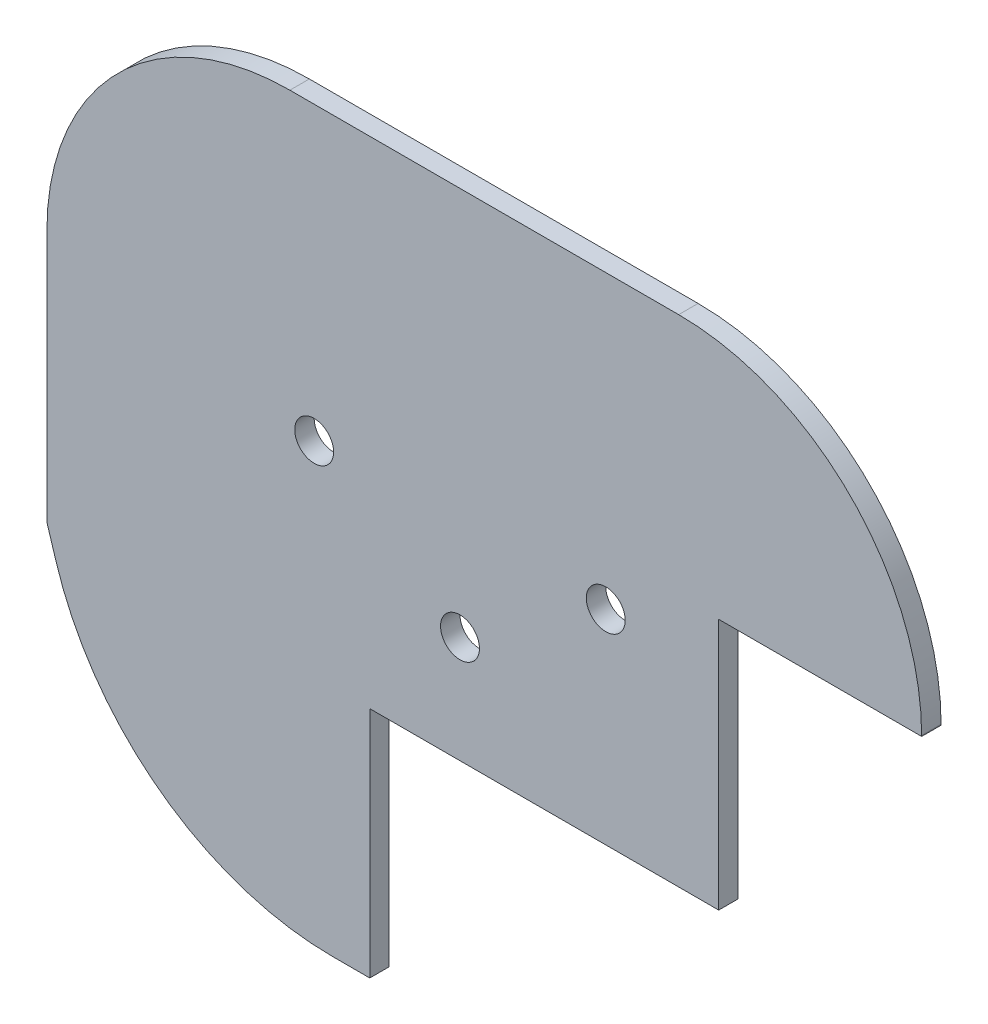
ISO-10303-21;
HEADER;
FILE_DESCRIPTION(('STEP AP214'),'2;1');
FILE_NAME('part.step','',(''),(''),'','','');
FILE_SCHEMA(('AUTOMOTIVE_DESIGN { 1 0 10303 214 1 1 1 1 }'));
ENDSEC;
DATA;
#1=APPLICATION_CONTEXT('core data for automotive mechanical design processes');
#2=APPLICATION_PROTOCOL_DEFINITION('international standard','automotive_design',2000,#1);
#3=PRODUCT_CONTEXT('',#1,'mechanical');
#4=PRODUCT('Part','Part','',(#3));
#5=PRODUCT_RELATED_PRODUCT_CATEGORY('part','',(#4));
#6=PRODUCT_DEFINITION_FORMATION('','',#4);
#7=PRODUCT_DEFINITION_CONTEXT('part definition',#1,'design');
#8=PRODUCT_DEFINITION('design','',#6,#7);
#9=PRODUCT_DEFINITION_SHAPE('','',#8);
#10=(LENGTH_UNIT() NAMED_UNIT(*) SI_UNIT(.MILLI.,.METRE.));
#11=(NAMED_UNIT(*) PLANE_ANGLE_UNIT() SI_UNIT($,.RADIAN.));
#12=(NAMED_UNIT(*) SI_UNIT($,.STERADIAN.) SOLID_ANGLE_UNIT());
#13=UNCERTAINTY_MEASURE_WITH_UNIT(LENGTH_MEASURE(1.E-05),#10,'distance_accuracy_value','');
#14=(GEOMETRIC_REPRESENTATION_CONTEXT(3) GLOBAL_UNCERTAINTY_ASSIGNED_CONTEXT((#13)) GLOBAL_UNIT_ASSIGNED_CONTEXT((#10,
#11,#12)) REPRESENTATION_CONTEXT('',''));
#15=CARTESIAN_POINT('',(0.,0.,0.));
#16=DIRECTION('',(0.,0.,1.));
#17=DIRECTION('',(1.,0.,0.));
#18=AXIS2_PLACEMENT_3D('',#15,#16,#17);
#19=CARTESIAN_POINT('',(0.,0.,0.));
#20=DIRECTION('',(0.,0.,1.));
#21=DIRECTION('',(1.,0.,0.));
#22=AXIS2_PLACEMENT_3D('',#19,#20,#21);
#23=PLANE('',#22);
#24=CARTESIAN_POINT('',(-8.65887450304571,10.5,0.));
#25=DIRECTION('',(0.,0.,1.));
#26=DIRECTION('',(1.,0.,0.));
#27=AXIS2_PLACEMENT_3D('',#24,#25,#26);
#28=CIRCLE('',#27,1.);
#29=CARTESIAN_POINT('',(-7.65887450304571,10.5,0.));
#30=VERTEX_POINT('',#29);
#31=EDGE_CURVE('E161',#30,#30,#28,.T.);
#32=ORIENTED_EDGE('',*,*,#31,.T.);
#33=EDGE_LOOP('',(#32));
#34=FACE_BOUND('',#33,.T.);
#35=CARTESIAN_POINT('',(-23.6588745030457,10.5,0.));
#36=DIRECTION('',(0.,0.,1.));
#37=DIRECTION('',(1.,0.,0.));
#38=AXIS2_PLACEMENT_3D('',#35,#36,#37);
#39=CIRCLE('',#38,1.);
#40=CARTESIAN_POINT('',(-22.6588745030457,10.5,0.));
#41=VERTEX_POINT('',#40);
#42=EDGE_CURVE('E345',#41,#41,#39,.T.);
#43=ORIENTED_EDGE('',*,*,#42,.T.);
#44=EDGE_LOOP('',(#43));
#45=FACE_BOUND('',#44,.T.);
#46=CARTESIAN_POINT('',(-16.1588745030457,5.5,0.));
#47=DIRECTION('',(0.,0.,1.));
#48=DIRECTION('',(1.,0.,0.));
#49=AXIS2_PLACEMENT_3D('',#46,#47,#48);
#50=CIRCLE('',#49,1.);
#51=CARTESIAN_POINT('',(-15.1588745030457,5.5,0.));
#52=VERTEX_POINT('',#51);
#53=EDGE_CURVE('E338',#52,#52,#50,.T.);
#54=ORIENTED_EDGE('',*,*,#53,.T.);
#55=EDGE_LOOP('',(#54));
#56=FACE_BOUND('',#55,.T.);
#57=CARTESIAN_POINT('',(-7.85,10.9354252578534,0.));
#58=DIRECTION('',(0.,0.,1.));
#59=DIRECTION('',(1.,0.,0.));
#60=AXIS2_PLACEMENT_3D('',#57,#58,#59);
#61=CIRCLE('',#60,5.2);
#62=CARTESIAN_POINT('',(-2.84887450304571,12.3597650219945,0.));
#63=VERTEX_POINT('',#62);
#64=CARTESIAN_POINT('',(-6.21588694243432,15.8719903101031,0.));
#65=VERTEX_POINT('',#64);
#66=EDGE_CURVE('E11',#63,#65,#61,.T.);
#67=ORIENTED_EDGE('',*,*,#66,.F.);
#68=DIRECTION('',(0.,1.,0.));
#69=VECTOR('',#68,1.);
#70=CARTESIAN_POINT('',(-2.8488745030457,0.,0.));
#71=LINE('',#70,#69);
#72=CARTESIAN_POINT('',(-2.8488745030457,0.,0.));
#73=VERTEX_POINT('',#72);
#74=EDGE_CURVE('E169',#73,#63,#71,.T.);
#75=ORIENTED_EDGE('',*,*,#74,.F.);
#76=DIRECTION('',(1.,0.,0.));
#77=VECTOR('',#76,1.);
#78=CARTESIAN_POINT('',(0.,0.,0.));
#79=LINE('',#78,#77);
#80=CARTESIAN_POINT('',(-20.8,0.,0.));
#81=VERTEX_POINT('',#80);
#82=EDGE_CURVE('E167',#81,#73,#79,.T.);
#83=ORIENTED_EDGE('',*,*,#82,.F.);
#84=DIRECTION('',(0.,1.,0.));
#85=VECTOR('',#84,1.);
#86=CARTESIAN_POINT('',(-20.8,0.,0.));
#87=LINE('',#86,#85);
#88=CARTESIAN_POINT('',(-20.8,-12.,0.));
#89=VERTEX_POINT('',#88);
#90=EDGE_CURVE('E165',#89,#81,#87,.T.);
#91=ORIENTED_EDGE('',*,*,#90,.F.);
#92=DIRECTION('',(1.,0.,0.));
#93=VECTOR('',#92,1.);
#94=CARTESIAN_POINT('',(0.,-12.,0.));
#95=LINE('',#94,#93);
#96=CARTESIAN_POINT('',(-22.7,-12.,0.));
#97=VERTEX_POINT('',#96);
#98=EDGE_CURVE('E163',#97,#89,#95,.T.);
#99=ORIENTED_EDGE('',*,*,#98,.F.);
#100=CARTESIAN_POINT('',(-22.7,2.9088745030457,0.));
#101=DIRECTION('',(0.,0.,1.));
#102=DIRECTION('',(1.,0.,0.));
#103=AXIS2_PLACEMENT_3D('',#100,#101,#102);
#104=CIRCLE('',#103,14.9088745030457);
#105=CARTESIAN_POINT('',(-36.9354968743474,-1.52115570994522,0.));
#106=VERTEX_POINT('',#105);
#107=EDGE_CURVE('E160',#106,#97,#104,.T.);
#108=ORIENTED_EDGE('',*,*,#107,.F.);
#109=DIRECTION('',(0.297140485828487,-0.954833771753812,0.));
#110=VECTOR('',#109,1.);
#111=CARTESIAN_POINT('',(-34.1059526361589,-10.6136373008019,0.));
#112=LINE('',#111,#110);
#113=CARTESIAN_POINT('',(-37.4088745030457,0.,0.));
#114=VERTEX_POINT('',#113);
#115=EDGE_CURVE('E157',#114,#106,#112,.T.);
#116=ORIENTED_EDGE('',*,*,#115,.F.);
#117=DIRECTION('',(0.,-1.,0.));
#118=VECTOR('',#117,1.);
#119=CARTESIAN_POINT('',(-37.4088745030457,0.,0.));
#120=LINE('',#119,#118);
#121=CARTESIAN_POINT('',(-37.4088745030457,13.,0.));
#122=VERTEX_POINT('',#121);
#123=EDGE_CURVE('E96',#122,#114,#120,.T.);
#124=ORIENTED_EDGE('',*,*,#123,.F.);
#125=CARTESIAN_POINT('',(-24.9088745030457,13.,0.));
#126=DIRECTION('',(0.,0.,1.));
#127=DIRECTION('',(1.,0.,0.));
#128=AXIS2_PLACEMENT_3D('',#125,#126,#127);
#129=CIRCLE('',#128,12.5);
#130=CARTESIAN_POINT('',(-24.9088745030457,25.5,0.));
#131=VERTEX_POINT('',#130);
#132=EDGE_CURVE('E90',#131,#122,#129,.T.);
#133=ORIENTED_EDGE('',*,*,#132,.F.);
#134=DIRECTION('',(-1.,0.,0.));
#135=VECTOR('',#134,1.);
#136=CARTESIAN_POINT('',(0.,25.5,0.));
#137=LINE('',#136,#135);
#138=CARTESIAN_POINT('',(-4.90887450304571,25.5,0.));
#139=VERTEX_POINT('',#138);
#140=EDGE_CURVE('E147',#139,#131,#137,.T.);
#141=ORIENTED_EDGE('',*,*,#140,.F.);
#142=CARTESIAN_POINT('',(-4.90887450304571,13.,0.));
#143=DIRECTION('',(0.,0.,1.));
#144=DIRECTION('',(1.,0.,0.));
#145=AXIS2_PLACEMENT_3D('',#142,#143,#144);
#146=CIRCLE('',#145,12.5);
#147=CARTESIAN_POINT('',(7.59112549695429,13.,0.));
#148=VERTEX_POINT('',#147);
#149=EDGE_CURVE('E176',#148,#139,#146,.T.);
#150=ORIENTED_EDGE('',*,*,#149,.F.);
#151=DIRECTION('',(0.,1.,0.));
#152=VECTOR('',#151,1.);
#153=CARTESIAN_POINT('',(7.59112549695429,0.,0.));
#154=LINE('',#153,#152);
#155=CARTESIAN_POINT('',(7.59112549695429,12.9567512584362,0.));
#156=VERTEX_POINT('',#155);
#157=EDGE_CURVE('E174',#156,#148,#154,.T.);
#158=ORIENTED_EDGE('',*,*,#157,.F.);
#159=DIRECTION('',(1.,0.,0.));
#160=VECTOR('',#159,1.);
#161=CARTESIAN_POINT('',(0.,12.9567512584362,0.));
#162=LINE('',#161,#160);
#163=CARTESIAN_POINT('',(3.16607292451135,12.9567512584362,0.));
#164=VERTEX_POINT('',#163);
#165=EDGE_CURVE('E172',#164,#156,#162,.T.);
#166=ORIENTED_EDGE('',*,*,#165,.F.);
#167=DIRECTION('',(0.0398110868482037,0.999207224435435,0.));
#168=VECTOR('',#167,1.);
#169=CARTESIAN_POINT('',(2.64564152560021,-0.105409430565711,0.));
#170=LINE('',#169,#168);
#171=CARTESIAN_POINT('',(3.36703490284155,18.0006391922175,0.));
#172=VERTEX_POINT('',#171);
#173=EDGE_CURVE('E208',#164,#172,#170,.T.);
#174=ORIENTED_EDGE('',*,*,#173,.T.);
#175=CARTESIAN_POINT('',(-1.42915977444854,18.1917324090889,0.));
#176=DIRECTION('',(0.,0.,1.));
#177=DIRECTION('',(1.,0.,0.));
#178=AXIS2_PLACEMENT_3D('',#175,#176,#177);
#179=CIRCLE('',#178,4.8);
#180=CARTESIAN_POINT('',(1.2432611371141,22.1789828992692,0.));
#181=VERTEX_POINT('',#180);
#182=EDGE_CURVE('E211',#172,#181,#179,.T.);
#183=ORIENTED_EDGE('',*,*,#182,.T.);
#184=CARTESIAN_POINT('',(-4.90887450304571,13.,0.));
#185=DIRECTION('',(0.,0.,1.));
#186=DIRECTION('',(1.,0.,0.));
#187=AXIS2_PLACEMENT_3D('',#184,#185,#186);
#188=CIRCLE('',#187,11.05);
#189=CARTESIAN_POINT('',(-4.90887450304571,24.05,0.));
#190=VERTEX_POINT('',#189);
#191=EDGE_CURVE('E214',#181,#190,#188,.T.);
#192=ORIENTED_EDGE('',*,*,#191,.T.);
#193=DIRECTION('',(1.,0.,0.));
#194=VECTOR('',#193,1.);
#195=CARTESIAN_POINT('',(0.,24.05,0.));
#196=LINE('',#195,#194);
#197=CARTESIAN_POINT('',(-24.9088745030457,24.05,0.));
#198=VERTEX_POINT('',#197);
#199=EDGE_CURVE('E217',#198,#190,#196,.T.);
#200=ORIENTED_EDGE('',*,*,#199,.F.);
#201=CARTESIAN_POINT('',(-24.9088745030457,13.,0.));
#202=DIRECTION('',(0.,0.,1.));
#203=DIRECTION('',(1.,0.,0.));
#204=AXIS2_PLACEMENT_3D('',#201,#202,#203);
#205=CIRCLE('',#204,11.05);
#206=CARTESIAN_POINT('',(-35.9588745030457,13.,0.));
#207=VERTEX_POINT('',#206);
#208=EDGE_CURVE('E220',#198,#207,#205,.T.);
#209=ORIENTED_EDGE('',*,*,#208,.T.);
#210=DIRECTION('',(0.,1.,0.));
#211=VECTOR('',#210,1.);
#212=CARTESIAN_POINT('',(-35.9588745030457,0.,0.));
#213=LINE('',#212,#211);
#214=CARTESIAN_POINT('',(-35.9588745030457,1.5438872445632,0.));
#215=VERTEX_POINT('',#214);
#216=EDGE_CURVE('E223',#215,#207,#213,.T.);
#217=ORIENTED_EDGE('',*,*,#216,.F.);
#218=CARTESIAN_POINT('',(-27.1588745030457,1.5438872445632,0.));
#219=DIRECTION('',(0.,0.,1.));
#220=DIRECTION('',(1.,0.,0.));
#221=AXIS2_PLACEMENT_3D('',#218,#219,#220);
#222=CIRCLE('',#221,8.79999999999997);
#223=CARTESIAN_POINT('',(-35.4557641572824,-1.3889649619791,0.));
#224=VERTEX_POINT('',#223);
#225=EDGE_CURVE('E226',#215,#224,#222,.T.);
#226=ORIENTED_EDGE('',*,*,#225,.T.);
#227=DIRECTION('',(-0.333278659834364,0.942828369799621,0.));
#228=VECTOR('',#227,1.);
#229=CARTESIAN_POINT('',(-31.9539739532313,-11.2953512607798,0.));
#230=LINE('',#229,#228);
#231=CARTESIAN_POINT('',(-35.3894087070442,-1.57668115420848,0.));
#232=VERTEX_POINT('',#231);
#233=EDGE_CURVE('E229',#232,#224,#230,.T.);
#234=ORIENTED_EDGE('',*,*,#233,.F.);
#235=CARTESIAN_POINT('',(-22.7,2.9088745030457,0.));
#236=DIRECTION('',(0.,0.,1.));
#237=DIRECTION('',(1.,0.,0.));
#238=AXIS2_PLACEMENT_3D('',#235,#236,#237);
#239=CIRCLE('',#238,13.4588745030457);
#240=CARTESIAN_POINT('',(-22.7,-10.55,0.));
#241=VERTEX_POINT('',#240);
#242=EDGE_CURVE('E232',#232,#241,#239,.T.);
#243=ORIENTED_EDGE('',*,*,#242,.T.);
#244=DIRECTION('',(-1.,0.,0.));
#245=VECTOR('',#244,1.);
#246=CARTESIAN_POINT('',(0.,-10.55,0.));
#247=LINE('',#246,#245);
#248=CARTESIAN_POINT('',(-21.8,-10.55,0.));
#249=VERTEX_POINT('',#248);
#250=EDGE_CURVE('E235',#249,#241,#247,.T.);
#251=ORIENTED_EDGE('',*,*,#250,.F.);
#252=DIRECTION('',(0.,-1.,0.));
#253=VECTOR('',#252,1.);
#254=CARTESIAN_POINT('',(-21.8,0.,0.));
#255=LINE('',#254,#253);
#256=CARTESIAN_POINT('',(-21.8,-4.32223302559392,0.));
#257=VERTEX_POINT('',#256);
#258=EDGE_CURVE('E238',#257,#249,#255,.T.);
#259=ORIENTED_EDGE('',*,*,#258,.F.);
#260=CARTESIAN_POINT('',(-18.5229634923601,6.00627118165182,0.));
#261=DIRECTION('',(0.,0.,1.));
#262=DIRECTION('',(1.,0.,0.));
#263=AXIS2_PLACEMENT_3D('',#260,#261,#262);
#264=CIRCLE('',#263,10.8359110106856);
#265=CARTESIAN_POINT('',(-29.3588745030457,6.00627118165182,0.));
#266=VERTEX_POINT('',#265);
#267=EDGE_CURVE('E241',#266,#257,#264,.T.);
#268=ORIENTED_EDGE('',*,*,#267,.F.);
#269=DIRECTION('',(0.,-1.,0.));
#270=VECTOR('',#269,1.);
#271=CARTESIAN_POINT('',(-29.3588745030457,0.,0.));
#272=LINE('',#271,#270);
#273=CARTESIAN_POINT('',(-29.3588745030457,10.202170557507,0.));
#274=VERTEX_POINT('',#273);
#275=EDGE_CURVE('E244',#274,#266,#272,.T.);
#276=ORIENTED_EDGE('',*,*,#275,.F.);
#277=CARTESIAN_POINT('',(-23.1588745030457,10.202170557507,0.));
#278=DIRECTION('',(0.,0.,1.));
#279=DIRECTION('',(1.,0.,0.));
#280=AXIS2_PLACEMENT_3D('',#277,#278,#279);
#281=CIRCLE('',#280,6.20000000000001);
#282=CARTESIAN_POINT('',(-24.9368248531072,16.1417742945182,0.));
#283=VERTEX_POINT('',#282);
#284=EDGE_CURVE('E247',#283,#274,#281,.T.);
#285=ORIENTED_EDGE('',*,*,#284,.F.);
#286=CARTESIAN_POINT('',(-16.0044372515229,-13.6986780988618,0.));
#287=DIRECTION('',(0.,0.,1.));
#288=DIRECTION('',(1.,0.,0.));
#289=AXIS2_PLACEMENT_3D('',#286,#287,#288);
#290=CIRCLE('',#289,31.1486780988618);
#291=EDGE_CURVE('E43',#65,#283,#290,.T.);
#292=ORIENTED_EDGE('',*,*,#291,.F.);
#293=EDGE_LOOP('',(#67,#75,#83,#91,#99,#108,#116,#124,#133,#141,#150,#158,#166,#174,#183,#192,
#200,#209,#217,#226,#234,#243,#251,#259,#268,#276,#285,#292));
#294=FACE_BOUND('',#293,.T.);
#295=ADVANCED_FACE('F34',(#34,#45,#56,#294),#23,.F.);
#296=CARTESIAN_POINT('',(-34.1059526361589,-10.6136373008019,1.));
#297=DIRECTION('',(0.954833771753812,0.297140485828487,0.));
#298=DIRECTION('',(-0.297140485828487,0.954833771753812,0.));
#299=AXIS2_PLACEMENT_3D('',#296,#297,#298);
#300=PLANE('',#299);
#301=ORIENTED_EDGE('',*,*,#115,.T.);
#302=DIRECTION('',(0.,0.,-1.));
#303=VECTOR('',#302,1.);
#304=CARTESIAN_POINT('',(-36.9354968743474,-1.52115570994522,1.));
#305=LINE('',#304,#303);
#306=CARTESIAN_POINT('',(-36.9354968743474,-1.52115570994522,1.));
#307=VERTEX_POINT('',#306);
#308=EDGE_CURVE('E206',#307,#106,#305,.T.);
#309=ORIENTED_EDGE('',*,*,#308,.F.);
#310=DIRECTION('',(0.297140485828487,-0.954833771753812,0.));
#311=VECTOR('',#310,1.);
#312=CARTESIAN_POINT('',(-34.1059526361589,-10.6136373008019,1.));
#313=LINE('',#312,#311);
#314=CARTESIAN_POINT('',(-37.4088745030457,0.,1.));
#315=VERTEX_POINT('',#314);
#316=EDGE_CURVE('E181',#315,#307,#313,.T.);
#317=ORIENTED_EDGE('',*,*,#316,.F.);
#318=DIRECTION('',(0.,0.,-1.));
#319=VECTOR('',#318,1.);
#320=CARTESIAN_POINT('',(-37.4088745030457,0.,1.));
#321=LINE('',#320,#319);
#322=EDGE_CURVE('E153',#315,#114,#321,.T.);
#323=ORIENTED_EDGE('',*,*,#322,.T.);
#324=EDGE_LOOP('',(#301,#309,#317,#323));
#325=FACE_BOUND('',#324,.T.);
#326=ADVANCED_FACE('F36',(#325),#300,.F.);
#327=CARTESIAN_POINT('',(-22.7,2.9088745030457,1.));
#328=DIRECTION('',(0.,0.,-1.));
#329=DIRECTION('',(-1.,0.,0.));
#330=AXIS2_PLACEMENT_3D('',#327,#328,#329);
#331=CYLINDRICAL_SURFACE('',#330,14.9088745030457);
#332=ORIENTED_EDGE('',*,*,#107,.T.);
#333=DIRECTION('',(0.,0.,-1.));
#334=VECTOR('',#333,1.);
#335=CARTESIAN_POINT('',(-22.7,-12.,1.));
#336=LINE('',#335,#334);
#337=CARTESIAN_POINT('',(-22.7,-12.,1.));
#338=VERTEX_POINT('',#337);
#339=EDGE_CURVE('E203',#338,#97,#336,.T.);
#340=ORIENTED_EDGE('',*,*,#339,.F.);
#341=CARTESIAN_POINT('',(-22.7,2.9088745030457,1.));
#342=DIRECTION('',(0.,0.,1.));
#343=DIRECTION('',(1.,0.,0.));
#344=AXIS2_PLACEMENT_3D('',#341,#342,#343);
#345=CIRCLE('',#344,14.9088745030457);
#346=EDGE_CURVE('E105',#307,#338,#345,.T.);
#347=ORIENTED_EDGE('',*,*,#346,.F.);
#348=ORIENTED_EDGE('',*,*,#308,.T.);
#349=EDGE_LOOP('',(#332,#340,#347,#348));
#350=FACE_BOUND('',#349,.T.);
#351=ADVANCED_FACE('F399',(#350),#331,.T.);
#352=CARTESIAN_POINT('',(0.,-12.,1.));
#353=DIRECTION('',(0.,1.,0.));
#354=DIRECTION('',(0.,0.,1.));
#355=AXIS2_PLACEMENT_3D('',#352,#353,#354);
#356=PLANE('',#355);
#357=ORIENTED_EDGE('',*,*,#98,.T.);
#358=DIRECTION('',(0.,0.,-1.));
#359=VECTOR('',#358,1.);
#360=CARTESIAN_POINT('',(-20.8,-12.,1.));
#361=LINE('',#360,#359);
#362=CARTESIAN_POINT('',(-20.8,-12.,1.));
#363=VERTEX_POINT('',#362);
#364=EDGE_CURVE('E200',#363,#89,#361,.T.);
#365=ORIENTED_EDGE('',*,*,#364,.F.);
#366=DIRECTION('',(1.,0.,0.));
#367=VECTOR('',#366,1.);
#368=CARTESIAN_POINT('',(0.,-12.,1.));
#369=LINE('',#368,#367);
#370=EDGE_CURVE('E357',#338,#363,#369,.T.);
#371=ORIENTED_EDGE('',*,*,#370,.F.);
#372=ORIENTED_EDGE('',*,*,#339,.T.);
#373=EDGE_LOOP('',(#357,#365,#371,#372));
#374=FACE_BOUND('',#373,.T.);
#375=ADVANCED_FACE('F643',(#374),#356,.F.);
#376=CARTESIAN_POINT('',(-20.8,0.,1.));
#377=DIRECTION('',(-1.,0.,0.));
#378=DIRECTION('',(0.,-1.,0.));
#379=AXIS2_PLACEMENT_3D('',#376,#377,#378);
#380=PLANE('',#379);
#381=ORIENTED_EDGE('',*,*,#90,.T.);
#382=DIRECTION('',(0.,0.,-1.));
#383=VECTOR('',#382,1.);
#384=CARTESIAN_POINT('',(-20.8,0.,1.));
#385=LINE('',#384,#383);
#386=CARTESIAN_POINT('',(-20.8,0.,1.));
#387=VERTEX_POINT('',#386);
#388=EDGE_CURVE('E197',#387,#81,#385,.T.);
#389=ORIENTED_EDGE('',*,*,#388,.F.);
#390=DIRECTION('',(0.,1.,0.));
#391=VECTOR('',#390,1.);
#392=CARTESIAN_POINT('',(-20.8,0.,1.));
#393=LINE('',#392,#391);
#394=EDGE_CURVE('E359',#363,#387,#393,.T.);
#395=ORIENTED_EDGE('',*,*,#394,.F.);
#396=ORIENTED_EDGE('',*,*,#364,.T.);
#397=EDGE_LOOP('',(#381,#389,#395,#396));
#398=FACE_BOUND('',#397,.T.);
#399=ADVANCED_FACE('F639',(#398),#380,.F.);
#400=CARTESIAN_POINT('',(0.,0.,1.));
#401=DIRECTION('',(0.,1.,0.));
#402=DIRECTION('',(0.,0.,1.));
#403=AXIS2_PLACEMENT_3D('',#400,#401,#402);
#404=PLANE('',#403);
#405=ORIENTED_EDGE('',*,*,#82,.T.);
#406=DIRECTION('',(0.,0.,-1.));
#407=VECTOR('',#406,1.);
#408=CARTESIAN_POINT('',(-2.8488745030457,0.,1.));
#409=LINE('',#408,#407);
#410=CARTESIAN_POINT('',(-2.8488745030457,0.,1.));
#411=VERTEX_POINT('',#410);
#412=EDGE_CURVE('E194',#411,#73,#409,.T.);
#413=ORIENTED_EDGE('',*,*,#412,.F.);
#414=DIRECTION('',(1.,0.,0.));
#415=VECTOR('',#414,1.);
#416=CARTESIAN_POINT('',(0.,0.,1.));
#417=LINE('',#416,#415);
#418=EDGE_CURVE('E361',#387,#411,#417,.T.);
#419=ORIENTED_EDGE('',*,*,#418,.F.);
#420=ORIENTED_EDGE('',*,*,#388,.T.);
#421=EDGE_LOOP('',(#405,#413,#419,#420));
#422=FACE_BOUND('',#421,.T.);
#423=ADVANCED_FACE('F633',(#422),#404,.F.);
#424=CARTESIAN_POINT('',(-2.8488745030457,0.,1.));
#425=DIRECTION('',(-1.,0.,0.));
#426=DIRECTION('',(0.,-1.,0.));
#427=AXIS2_PLACEMENT_3D('',#424,#425,#426);
#428=PLANE('',#427);
#429=DIRECTION('',(0.,0.,-1.));
#430=VECTOR('',#429,1.);
#431=CARTESIAN_POINT('',(-2.84887450304571,12.9567512584362,1.));
#432=LINE('',#431,#430);
#433=CARTESIAN_POINT('',(-2.84887450304571,12.9567512584362,1.));
#434=VERTEX_POINT('',#433);
#435=CARTESIAN_POINT('',(-2.84887450304571,12.9567512584362,-1.));
#436=VERTEX_POINT('',#435);
#437=EDGE_CURVE('E191',#434,#436,#432,.T.);
#438=ORIENTED_EDGE('',*,*,#437,.F.);
#439=DIRECTION('',(0.,1.,0.));
#440=VECTOR('',#439,1.);
#441=CARTESIAN_POINT('',(-2.8488745030457,0.,1.));
#442=LINE('',#441,#440);
#443=EDGE_CURVE('E363',#411,#434,#442,.T.);
#444=ORIENTED_EDGE('',*,*,#443,.F.);
#445=ORIENTED_EDGE('',*,*,#412,.T.);
#446=ORIENTED_EDGE('',*,*,#74,.T.);
#447=DIRECTION('',(0.,0.,1.));
#448=VECTOR('',#447,1.);
#449=CARTESIAN_POINT('',(-2.84887450304571,12.3597650219945,-1.));
#450=LINE('',#449,#448);
#451=CARTESIAN_POINT('',(-2.84887450304571,12.3597650219945,-1.));
#452=VERTEX_POINT('',#451);
#453=EDGE_CURVE('E334',#452,#63,#450,.T.);
#454=ORIENTED_EDGE('',*,*,#453,.F.);
#455=DIRECTION('',(0.,1.,0.));
#456=VECTOR('',#455,1.);
#457=CARTESIAN_POINT('',(-2.8488745030457,0.,-1.));
#458=LINE('',#457,#456);
#459=EDGE_CURVE('E483',#452,#436,#458,.T.);
#460=ORIENTED_EDGE('',*,*,#459,.T.);
#461=EDGE_LOOP('',(#438,#444,#445,#446,#454,#460));
#462=FACE_BOUND('',#461,.T.);
#463=ADVANCED_FACE('F535',(#462),#428,.F.);
#464=CARTESIAN_POINT('',(0.,12.9567512584362,1.));
#465=DIRECTION('',(0.,1.,0.));
#466=DIRECTION('',(0.,0.,1.));
#467=AXIS2_PLACEMENT_3D('',#464,#465,#466);
#468=PLANE('',#467);
#469=DIRECTION('',(0.,0.,-1.));
#470=VECTOR('',#469,1.);
#471=CARTESIAN_POINT('',(7.59112549695429,12.9567512584362,1.));
#472=LINE('',#471,#470);
#473=CARTESIAN_POINT('',(7.59112549695429,12.9567512584362,1.));
#474=VERTEX_POINT('',#473);
#475=EDGE_CURVE('E188',#474,#156,#472,.T.);
#476=ORIENTED_EDGE('',*,*,#475,.F.);
#477=DIRECTION('',(1.,0.,0.));
#478=VECTOR('',#477,1.);
#479=CARTESIAN_POINT('',(0.,12.9567512584362,1.));
#480=LINE('',#479,#478);
#481=EDGE_CURVE('E365',#434,#474,#480,.T.);
#482=ORIENTED_EDGE('',*,*,#481,.F.);
#483=ORIENTED_EDGE('',*,*,#437,.T.);
#484=DIRECTION('',(1.,0.,0.));
#485=VECTOR('',#484,1.);
#486=CARTESIAN_POINT('',(0.,12.9567512584362,-1.));
#487=LINE('',#486,#485);
#488=CARTESIAN_POINT('',(3.16607292451135,12.9567512584362,-1.));
#489=VERTEX_POINT('',#488);
#490=EDGE_CURVE('E528',#436,#489,#487,.T.);
#491=ORIENTED_EDGE('',*,*,#490,.T.);
#492=DIRECTION('',(0.,0.,1.));
#493=VECTOR('',#492,1.);
#494=CARTESIAN_POINT('',(3.16607292451135,12.9567512584362,-1.));
#495=LINE('',#494,#493);
#496=EDGE_CURVE('E331',#489,#164,#495,.T.);
#497=ORIENTED_EDGE('',*,*,#496,.T.);
#498=ORIENTED_EDGE('',*,*,#165,.T.);
#499=EDGE_LOOP('',(#476,#482,#483,#491,#497,#498));
#500=FACE_BOUND('',#499,.T.);
#501=ADVANCED_FACE('F625',(#500),#468,.F.);
#502=CARTESIAN_POINT('',(7.59112549695429,0.,1.));
#503=DIRECTION('',(-1.,0.,0.));
#504=DIRECTION('',(0.,0.,1.));
#505=AXIS2_PLACEMENT_3D('',#502,#503,#504);
#506=PLANE('',#505);
#507=ORIENTED_EDGE('',*,*,#157,.T.);
#508=DIRECTION('',(0.,0.,-1.));
#509=VECTOR('',#508,1.);
#510=CARTESIAN_POINT('',(7.59112549695429,13.,1.));
#511=LINE('',#510,#509);
#512=CARTESIAN_POINT('',(7.59112549695429,13.,1.));
#513=VERTEX_POINT('',#512);
#514=EDGE_CURVE('E185',#513,#148,#511,.T.);
#515=ORIENTED_EDGE('',*,*,#514,.F.);
#516=DIRECTION('',(0.,1.,0.));
#517=VECTOR('',#516,1.);
#518=CARTESIAN_POINT('',(7.59112549695429,0.,1.));
#519=LINE('',#518,#517);
#520=EDGE_CURVE('E367',#474,#513,#519,.T.);
#521=ORIENTED_EDGE('',*,*,#520,.F.);
#522=ORIENTED_EDGE('',*,*,#475,.T.);
#523=EDGE_LOOP('',(#507,#515,#521,#522));
#524=FACE_BOUND('',#523,.T.);
#525=ADVANCED_FACE('F373',(#524),#506,.F.);
#526=CARTESIAN_POINT('',(-4.90887450304571,13.,1.));
#527=DIRECTION('',(0.,0.,-1.));
#528=DIRECTION('',(-1.,0.,0.));
#529=AXIS2_PLACEMENT_3D('',#526,#527,#528);
#530=CYLINDRICAL_SURFACE('',#529,12.5);
#531=ORIENTED_EDGE('',*,*,#149,.T.);
#532=DIRECTION('',(0.,0.,-1.));
#533=VECTOR('',#532,1.);
#534=CARTESIAN_POINT('',(-4.90887450304571,25.5,1.));
#535=LINE('',#534,#533);
#536=CARTESIAN_POINT('',(-4.90887450304571,25.5,1.));
#537=VERTEX_POINT('',#536);
#538=EDGE_CURVE('E148',#537,#139,#535,.T.);
#539=ORIENTED_EDGE('',*,*,#538,.F.);
#540=CARTESIAN_POINT('',(-4.90887450304571,13.,1.));
#541=DIRECTION('',(0.,0.,1.));
#542=DIRECTION('',(1.,0.,0.));
#543=AXIS2_PLACEMENT_3D('',#540,#541,#542);
#544=CIRCLE('',#543,12.5);
#545=EDGE_CURVE('E139',#513,#537,#544,.T.);
#546=ORIENTED_EDGE('',*,*,#545,.F.);
#547=ORIENTED_EDGE('',*,*,#514,.T.);
#548=EDGE_LOOP('',(#531,#539,#546,#547));
#549=FACE_BOUND('',#548,.T.);
#550=ADVANCED_FACE('F377',(#549),#530,.T.);
#551=CARTESIAN_POINT('',(0.,25.5,1.));
#552=DIRECTION('',(0.,-1.,0.));
#553=DIRECTION('',(0.,0.,-1.));
#554=AXIS2_PLACEMENT_3D('',#551,#552,#553);
#555=PLANE('',#554);
#556=ORIENTED_EDGE('',*,*,#140,.T.);
#557=DIRECTION('',(0.,0.,-1.));
#558=VECTOR('',#557,1.);
#559=CARTESIAN_POINT('',(-24.9088745030457,25.5,1.));
#560=LINE('',#559,#558);
#561=CARTESIAN_POINT('',(-24.9088745030457,25.5,1.));
#562=VERTEX_POINT('',#561);
#563=EDGE_CURVE('E144',#562,#131,#560,.T.);
#564=ORIENTED_EDGE('',*,*,#563,.F.);
#565=DIRECTION('',(-1.,0.,0.));
#566=VECTOR('',#565,1.);
#567=CARTESIAN_POINT('',(0.,25.5,1.));
#568=LINE('',#567,#566);
#569=EDGE_CURVE('E132',#537,#562,#568,.T.);
#570=ORIENTED_EDGE('',*,*,#569,.F.);
#571=ORIENTED_EDGE('',*,*,#538,.T.);
#572=EDGE_LOOP('',(#556,#564,#570,#571));
#573=FACE_BOUND('',#572,.T.);
#574=ADVANCED_FACE('F145',(#573),#555,.F.);
#575=CARTESIAN_POINT('',(-24.9088745030457,13.,1.));
#576=DIRECTION('',(0.,0.,-1.));
#577=DIRECTION('',(-1.,0.,0.));
#578=AXIS2_PLACEMENT_3D('',#575,#576,#577);
#579=CYLINDRICAL_SURFACE('',#578,12.5);
#580=ORIENTED_EDGE('',*,*,#132,.T.);
#581=DIRECTION('',(0.,0.,-1.));
#582=VECTOR('',#581,1.);
#583=CARTESIAN_POINT('',(-37.4088745030457,13.,1.));
#584=LINE('',#583,#582);
#585=CARTESIAN_POINT('',(-37.4088745030457,13.,1.));
#586=VERTEX_POINT('',#585);
#587=EDGE_CURVE('E149',#586,#122,#584,.T.);
#588=ORIENTED_EDGE('',*,*,#587,.F.);
#589=CARTESIAN_POINT('',(-24.9088745030457,13.,1.));
#590=DIRECTION('',(0.,0.,1.));
#591=DIRECTION('',(1.,0.,0.));
#592=AXIS2_PLACEMENT_3D('',#589,#590,#591);
#593=CIRCLE('',#592,12.5);
#594=EDGE_CURVE('E137',#562,#586,#593,.T.);
#595=ORIENTED_EDGE('',*,*,#594,.F.);
#596=ORIENTED_EDGE('',*,*,#563,.T.);
#597=EDGE_LOOP('',(#580,#588,#595,#596));
#598=FACE_BOUND('',#597,.T.);
#599=ADVANCED_FACE('F151',(#598),#579,.T.);
#600=CARTESIAN_POINT('',(-37.4088745030457,0.,1.));
#601=DIRECTION('',(1.,0.,0.));
#602=DIRECTION('',(0.,0.,-1.));
#603=AXIS2_PLACEMENT_3D('',#600,#601,#602);
#604=PLANE('',#603);
#605=ORIENTED_EDGE('',*,*,#123,.T.);
#606=ORIENTED_EDGE('',*,*,#322,.F.);
#607=DIRECTION('',(0.,-1.,0.));
#608=VECTOR('',#607,1.);
#609=CARTESIAN_POINT('',(-37.4088745030457,0.,1.));
#610=LINE('',#609,#608);
#611=EDGE_CURVE('E51',#586,#315,#610,.T.);
#612=ORIENTED_EDGE('',*,*,#611,.F.);
#613=ORIENTED_EDGE('',*,*,#587,.T.);
#614=EDGE_LOOP('',(#605,#606,#612,#613));
#615=FACE_BOUND('',#614,.T.);
#616=ADVANCED_FACE('F383',(#615),#604,.F.);
#617=CARTESIAN_POINT('',(0.,0.,1.));
#618=DIRECTION('',(0.,0.,1.));
#619=DIRECTION('',(1.,0.,0.));
#620=AXIS2_PLACEMENT_3D('',#617,#618,#619);
#621=PLANE('',#620);
#622=ORIENTED_EDGE('',*,*,#443,.T.);
#623=ORIENTED_EDGE('',*,*,#481,.T.);
#624=ORIENTED_EDGE('',*,*,#520,.T.);
#625=ORIENTED_EDGE('',*,*,#545,.T.);
#626=ORIENTED_EDGE('',*,*,#569,.T.);
#627=ORIENTED_EDGE('',*,*,#594,.T.);
#628=ORIENTED_EDGE('',*,*,#611,.T.);
#629=ORIENTED_EDGE('',*,*,#316,.T.);
#630=ORIENTED_EDGE('',*,*,#346,.T.);
#631=ORIENTED_EDGE('',*,*,#370,.T.);
#632=ORIENTED_EDGE('',*,*,#394,.T.);
#633=ORIENTED_EDGE('',*,*,#418,.T.);
#634=EDGE_LOOP('',(#622,#623,#624,#625,#626,#627,#628,#629,#630,#631,#632,#633));
#635=FACE_BOUND('',#634,.T.);
#636=CARTESIAN_POINT('',(-16.1588745030457,5.5,1.));
#637=DIRECTION('',(0.,0.,1.));
#638=DIRECTION('',(1.,0.,0.));
#639=AXIS2_PLACEMENT_3D('',#636,#637,#638);
#640=CIRCLE('',#639,1.);
#641=CARTESIAN_POINT('',(-15.1588745030457,5.5,1.));
#642=VERTEX_POINT('',#641);
#643=EDGE_CURVE('E342',#642,#642,#640,.T.);
#644=ORIENTED_EDGE('',*,*,#643,.F.);
#645=EDGE_LOOP('',(#644));
#646=FACE_BOUND('',#645,.T.);
#647=CARTESIAN_POINT('',(-23.6588745030457,10.5,1.));
#648=DIRECTION('',(0.,0.,1.));
#649=DIRECTION('',(1.,0.,0.));
#650=AXIS2_PLACEMENT_3D('',#647,#648,#649);
#651=CIRCLE('',#650,1.);
#652=CARTESIAN_POINT('',(-22.6588745030457,10.5,1.));
#653=VERTEX_POINT('',#652);
#654=EDGE_CURVE('E341',#653,#653,#651,.T.);
#655=ORIENTED_EDGE('',*,*,#654,.F.);
#656=EDGE_LOOP('',(#655));
#657=FACE_BOUND('',#656,.T.);
#658=CARTESIAN_POINT('',(-8.65887450304571,10.5,1.));
#659=DIRECTION('',(0.,0.,1.));
#660=DIRECTION('',(1.,0.,0.));
#661=AXIS2_PLACEMENT_3D('',#658,#659,#660);
#662=CIRCLE('',#661,1.);
#663=CARTESIAN_POINT('',(-7.65887450304571,10.5,1.));
#664=VERTEX_POINT('',#663);
#665=EDGE_CURVE('E348',#664,#664,#662,.T.);
#666=ORIENTED_EDGE('',*,*,#665,.F.);
#667=EDGE_LOOP('',(#666));
#668=FACE_BOUND('',#667,.T.);
#669=ADVANCED_FACE('F134',(#635,#646,#657,#668),#621,.T.);
#670=CARTESIAN_POINT('',(-8.65887450304571,10.5,0.));
#671=DIRECTION('',(0.,0.,1.));
#672=DIRECTION('',(1.,0.,0.));
#673=AXIS2_PLACEMENT_3D('',#670,#671,#672);
#674=CYLINDRICAL_SURFACE('',#673,1.);
#675=ORIENTED_EDGE('',*,*,#31,.F.);
#676=EDGE_LOOP('',(#675));
#677=FACE_BOUND('',#676,.T.);
#678=ORIENTED_EDGE('',*,*,#665,.T.);
#679=EDGE_LOOP('',(#678));
#680=FACE_BOUND('',#679,.T.);
#681=ADVANCED_FACE('F390',(#677,#680),#674,.F.);
#682=CARTESIAN_POINT('',(-23.6588745030457,10.5,0.));
#683=DIRECTION('',(0.,0.,1.));
#684=DIRECTION('',(1.,0.,0.));
#685=AXIS2_PLACEMENT_3D('',#682,#683,#684);
#686=CYLINDRICAL_SURFACE('',#685,1.);
#687=ORIENTED_EDGE('',*,*,#42,.F.);
#688=EDGE_LOOP('',(#687));
#689=FACE_BOUND('',#688,.T.);
#690=ORIENTED_EDGE('',*,*,#654,.T.);
#691=EDGE_LOOP('',(#690));
#692=FACE_BOUND('',#691,.T.);
#693=ADVANCED_FACE('F404',(#689,#692),#686,.F.);
#694=CARTESIAN_POINT('',(-16.1588745030457,5.5,0.));
#695=DIRECTION('',(0.,0.,1.));
#696=DIRECTION('',(1.,0.,0.));
#697=AXIS2_PLACEMENT_3D('',#694,#695,#696);
#698=CYLINDRICAL_SURFACE('',#697,1.);
#699=ORIENTED_EDGE('',*,*,#53,.F.);
#700=EDGE_LOOP('',(#699));
#701=FACE_BOUND('',#700,.T.);
#702=ORIENTED_EDGE('',*,*,#643,.T.);
#703=EDGE_LOOP('',(#702));
#704=FACE_BOUND('',#703,.T.);
#705=ADVANCED_FACE('F408',(#701,#704),#698,.F.);
#706=CARTESIAN_POINT('',(-7.85,10.9354252578534,-1.));
#707=DIRECTION('',(0.,0.,1.));
#708=DIRECTION('',(1.,0.,0.));
#709=AXIS2_PLACEMENT_3D('',#706,#707,#708);
#710=CYLINDRICAL_SURFACE('',#709,5.2);
#711=ORIENTED_EDGE('',*,*,#453,.T.);
#712=ORIENTED_EDGE('',*,*,#66,.T.);
#713=DIRECTION('',(0.,0.,1.));
#714=VECTOR('',#713,1.);
#715=CARTESIAN_POINT('',(-6.21588694243432,15.8719903101031,-1.));
#716=LINE('',#715,#714);
#717=CARTESIAN_POINT('',(-6.21588694243432,15.8719903101031,-1.));
#718=VERTEX_POINT('',#717);
#719=EDGE_CURVE('E262',#718,#65,#716,.T.);
#720=ORIENTED_EDGE('',*,*,#719,.F.);
#721=CARTESIAN_POINT('',(-7.85,10.9354252578534,-1.));
#722=DIRECTION('',(0.,0.,1.));
#723=DIRECTION('',(1.,0.,0.));
#724=AXIS2_PLACEMENT_3D('',#721,#722,#723);
#725=CIRCLE('',#724,5.2);
#726=EDGE_CURVE('E479',#452,#718,#725,.T.);
#727=ORIENTED_EDGE('',*,*,#726,.F.);
#728=EDGE_LOOP('',(#711,#712,#720,#727));
#729=FACE_BOUND('',#728,.T.);
#730=ADVANCED_FACE('F412',(#729),#710,.F.);
#731=CARTESIAN_POINT('',(-16.0044372515229,-13.6986780988618,-1.));
#732=DIRECTION('',(0.,0.,1.));
#733=DIRECTION('',(1.,0.,0.));
#734=AXIS2_PLACEMENT_3D('',#731,#732,#733);
#735=CYLINDRICAL_SURFACE('',#734,31.1486780988618);
#736=ORIENTED_EDGE('',*,*,#719,.T.);
#737=ORIENTED_EDGE('',*,*,#291,.T.);
#738=DIRECTION('',(0.,0.,1.));
#739=VECTOR('',#738,1.);
#740=CARTESIAN_POINT('',(-24.9368248531072,16.1417742945182,-1.));
#741=LINE('',#740,#739);
#742=CARTESIAN_POINT('',(-24.9368248531072,16.1417742945182,-1.));
#743=VERTEX_POINT('',#742);
#744=EDGE_CURVE('E259',#743,#283,#741,.T.);
#745=ORIENTED_EDGE('',*,*,#744,.F.);
#746=CARTESIAN_POINT('',(-16.0044372515229,-13.6986780988618,-1.));
#747=DIRECTION('',(0.,0.,1.));
#748=DIRECTION('',(1.,0.,0.));
#749=AXIS2_PLACEMENT_3D('',#746,#747,#748);
#750=CIRCLE('',#749,31.1486780988618);
#751=EDGE_CURVE('E337',#718,#743,#750,.T.);
#752=ORIENTED_EDGE('',*,*,#751,.F.);
#753=EDGE_LOOP('',(#736,#737,#745,#752));
#754=FACE_BOUND('',#753,.T.);
#755=ADVANCED_FACE('F256',(#754),#735,.F.);
#756=CARTESIAN_POINT('',(-23.1588745030457,10.202170557507,-1.));
#757=DIRECTION('',(0.,0.,1.));
#758=DIRECTION('',(1.,0.,0.));
#759=AXIS2_PLACEMENT_3D('',#756,#757,#758);
#760=CYLINDRICAL_SURFACE('',#759,6.20000000000001);
#761=ORIENTED_EDGE('',*,*,#744,.T.);
#762=ORIENTED_EDGE('',*,*,#284,.T.);
#763=DIRECTION('',(0.,0.,1.));
#764=VECTOR('',#763,1.);
#765=CARTESIAN_POINT('',(-29.3588745030457,10.202170557507,-1.));
#766=LINE('',#765,#764);
#767=CARTESIAN_POINT('',(-29.3588745030457,10.202170557507,-1.));
#768=VERTEX_POINT('',#767);
#769=EDGE_CURVE('E273',#768,#274,#766,.T.);
#770=ORIENTED_EDGE('',*,*,#769,.F.);
#771=CARTESIAN_POINT('',(-23.1588745030457,10.202170557507,-1.));
#772=DIRECTION('',(0.,0.,1.));
#773=DIRECTION('',(1.,0.,0.));
#774=AXIS2_PLACEMENT_3D('',#771,#772,#773);
#775=CIRCLE('',#774,6.20000000000001);
#776=EDGE_CURVE('E272',#743,#768,#775,.T.);
#777=ORIENTED_EDGE('',*,*,#776,.F.);
#778=EDGE_LOOP('',(#761,#762,#770,#777));
#779=FACE_BOUND('',#778,.T.);
#780=ADVANCED_FACE('F268',(#779),#760,.F.);
#781=CARTESIAN_POINT('',(-29.3588745030457,0.,-1.));
#782=DIRECTION('',(-1.,0.,0.));
#783=DIRECTION('',(0.,-1.,0.));
#784=AXIS2_PLACEMENT_3D('',#781,#782,#783);
#785=PLANE('',#784);
#786=ORIENTED_EDGE('',*,*,#769,.T.);
#787=ORIENTED_EDGE('',*,*,#275,.T.);
#788=DIRECTION('',(0.,0.,1.));
#789=VECTOR('',#788,1.);
#790=CARTESIAN_POINT('',(-29.3588745030457,6.00627118165182,-1.));
#791=LINE('',#790,#789);
#792=CARTESIAN_POINT('',(-29.3588745030457,6.00627118165182,-1.));
#793=VERTEX_POINT('',#792);
#794=EDGE_CURVE('E286',#793,#266,#791,.T.);
#795=ORIENTED_EDGE('',*,*,#794,.F.);
#796=DIRECTION('',(0.,-1.,0.));
#797=VECTOR('',#796,1.);
#798=CARTESIAN_POINT('',(-29.3588745030457,0.,-1.));
#799=LINE('',#798,#797);
#800=EDGE_CURVE('E491',#768,#793,#799,.T.);
#801=ORIENTED_EDGE('',*,*,#800,.F.);
#802=EDGE_LOOP('',(#786,#787,#795,#801));
#803=FACE_BOUND('',#802,.T.);
#804=ADVANCED_FACE('F283',(#803),#785,.F.);
#805=CARTESIAN_POINT('',(-18.5229634923601,6.00627118165182,-1.));
#806=DIRECTION('',(0.,0.,1.));
#807=DIRECTION('',(1.,0.,0.));
#808=AXIS2_PLACEMENT_3D('',#805,#806,#807);
#809=CYLINDRICAL_SURFACE('',#808,10.8359110106856);
#810=ORIENTED_EDGE('',*,*,#794,.T.);
#811=ORIENTED_EDGE('',*,*,#267,.T.);
#812=DIRECTION('',(0.,0.,1.));
#813=VECTOR('',#812,1.);
#814=CARTESIAN_POINT('',(-21.8,-4.32223302559392,-1.));
#815=LINE('',#814,#813);
#816=CARTESIAN_POINT('',(-21.8,-4.32223302559392,-1.));
#817=VERTEX_POINT('',#816);
#818=EDGE_CURVE('E296',#817,#257,#815,.T.);
#819=ORIENTED_EDGE('',*,*,#818,.F.);
#820=CARTESIAN_POINT('',(-18.5229634923601,6.00627118165182,-1.));
#821=DIRECTION('',(0.,0.,1.));
#822=DIRECTION('',(1.,0.,0.));
#823=AXIS2_PLACEMENT_3D('',#820,#821,#822);
#824=CIRCLE('',#823,10.8359110106856);
#825=EDGE_CURVE('E295',#793,#817,#824,.T.);
#826=ORIENTED_EDGE('',*,*,#825,.F.);
#827=EDGE_LOOP('',(#810,#811,#819,#826));
#828=FACE_BOUND('',#827,.T.);
#829=ADVANCED_FACE('F291',(#828),#809,.F.);
#830=CARTESIAN_POINT('',(-21.8,0.,-1.));
#831=DIRECTION('',(-1.,0.,0.));
#832=DIRECTION('',(0.,0.,1.));
#833=AXIS2_PLACEMENT_3D('',#830,#831,#832);
#834=PLANE('',#833);
#835=ORIENTED_EDGE('',*,*,#818,.T.);
#836=ORIENTED_EDGE('',*,*,#258,.T.);
#837=DIRECTION('',(0.,0.,1.));
#838=VECTOR('',#837,1.);
#839=CARTESIAN_POINT('',(-21.8,-10.55,-1.));
#840=LINE('',#839,#838);
#841=CARTESIAN_POINT('',(-21.8,-10.55,-1.));
#842=VERTEX_POINT('',#841);
#843=EDGE_CURVE('E299',#842,#249,#840,.T.);
#844=ORIENTED_EDGE('',*,*,#843,.F.);
#845=DIRECTION('',(0.,-1.,0.));
#846=VECTOR('',#845,1.);
#847=CARTESIAN_POINT('',(-21.8,0.,-1.));
#848=LINE('',#847,#846);
#849=EDGE_CURVE('E495',#817,#842,#848,.T.);
#850=ORIENTED_EDGE('',*,*,#849,.F.);
#851=EDGE_LOOP('',(#835,#836,#844,#850));
#852=FACE_BOUND('',#851,.T.);
#853=ADVANCED_FACE('F457',(#852),#834,.F.);
#854=CARTESIAN_POINT('',(0.,-10.55,-1.));
#855=DIRECTION('',(0.,1.,0.));
#856=DIRECTION('',(-1.,0.,0.));
#857=AXIS2_PLACEMENT_3D('',#854,#855,#856);
#858=PLANE('',#857);
#859=ORIENTED_EDGE('',*,*,#843,.T.);
#860=ORIENTED_EDGE('',*,*,#250,.T.);
#861=DIRECTION('',(0.,0.,1.));
#862=VECTOR('',#861,1.);
#863=CARTESIAN_POINT('',(-22.7,-10.55,-1.));
#864=LINE('',#863,#862);
#865=CARTESIAN_POINT('',(-22.7,-10.55,-1.));
#866=VERTEX_POINT('',#865);
#867=EDGE_CURVE('E304',#866,#241,#864,.T.);
#868=ORIENTED_EDGE('',*,*,#867,.F.);
#869=DIRECTION('',(-1.,0.,0.));
#870=VECTOR('',#869,1.);
#871=CARTESIAN_POINT('',(0.,-10.55,-1.));
#872=LINE('',#871,#870);
#873=EDGE_CURVE('E498',#842,#866,#872,.T.);
#874=ORIENTED_EDGE('',*,*,#873,.F.);
#875=EDGE_LOOP('',(#859,#860,#868,#874));
#876=FACE_BOUND('',#875,.T.);
#877=ADVANCED_FACE('F453',(#876),#858,.F.);
#878=CARTESIAN_POINT('',(-22.7,2.9088745030457,-1.));
#879=DIRECTION('',(0.,0.,1.));
#880=DIRECTION('',(1.,0.,0.));
#881=AXIS2_PLACEMENT_3D('',#878,#879,#880);
#882=CYLINDRICAL_SURFACE('',#881,13.4588745030457);
#883=ORIENTED_EDGE('',*,*,#242,.F.);
#884=DIRECTION('',(0.,0.,1.));
#885=VECTOR('',#884,1.);
#886=CARTESIAN_POINT('',(-35.3894087070442,-1.57668115420848,-1.));
#887=LINE('',#886,#885);
#888=CARTESIAN_POINT('',(-35.3894087070442,-1.57668115420848,-1.));
#889=VERTEX_POINT('',#888);
#890=EDGE_CURVE('E307',#889,#232,#887,.T.);
#891=ORIENTED_EDGE('',*,*,#890,.F.);
#892=CARTESIAN_POINT('',(-22.7,2.9088745030457,-1.));
#893=DIRECTION('',(0.,0.,1.));
#894=DIRECTION('',(1.,0.,0.));
#895=AXIS2_PLACEMENT_3D('',#892,#893,#894);
#896=CIRCLE('',#895,13.4588745030457);
#897=EDGE_CURVE('E501',#889,#866,#896,.T.);
#898=ORIENTED_EDGE('',*,*,#897,.T.);
#899=ORIENTED_EDGE('',*,*,#867,.T.);
#900=EDGE_LOOP('',(#883,#891,#898,#899));
#901=FACE_BOUND('',#900,.T.);
#902=ADVANCED_FACE('F449',(#901),#882,.T.);
#903=CARTESIAN_POINT('',(-31.9539739532313,-11.2953512607798,-1.));
#904=DIRECTION('',(0.942828369799621,0.333278659834364,0.));
#905=DIRECTION('',(-0.333278659834364,0.942828369799621,0.));
#906=AXIS2_PLACEMENT_3D('',#903,#904,#905);
#907=PLANE('',#906);
#908=ORIENTED_EDGE('',*,*,#890,.T.);
#909=ORIENTED_EDGE('',*,*,#233,.T.);
#910=DIRECTION('',(0.,0.,1.));
#911=VECTOR('',#910,1.);
#912=CARTESIAN_POINT('',(-35.4557641572824,-1.3889649619791,-1.));
#913=LINE('',#912,#911);
#914=CARTESIAN_POINT('',(-35.4557641572824,-1.3889649619791,-1.));
#915=VERTEX_POINT('',#914);
#916=EDGE_CURVE('E310',#915,#224,#913,.T.);
#917=ORIENTED_EDGE('',*,*,#916,.F.);
#918=DIRECTION('',(-0.333278659834364,0.942828369799621,0.));
#919=VECTOR('',#918,1.);
#920=CARTESIAN_POINT('',(-31.9539739532313,-11.2953512607798,-1.));
#921=LINE('',#920,#919);
#922=EDGE_CURVE('E504',#889,#915,#921,.T.);
#923=ORIENTED_EDGE('',*,*,#922,.F.);
#924=EDGE_LOOP('',(#908,#909,#917,#923));
#925=FACE_BOUND('',#924,.T.);
#926=ADVANCED_FACE('F445',(#925),#907,.F.);
#927=CARTESIAN_POINT('',(-27.1588745030457,1.5438872445632,-1.));
#928=DIRECTION('',(0.,0.,1.));
#929=DIRECTION('',(1.,0.,0.));
#930=AXIS2_PLACEMENT_3D('',#927,#928,#929);
#931=CYLINDRICAL_SURFACE('',#930,8.79999999999997);
#932=ORIENTED_EDGE('',*,*,#225,.F.);
#933=DIRECTION('',(0.,0.,1.));
#934=VECTOR('',#933,1.);
#935=CARTESIAN_POINT('',(-35.9588745030457,1.5438872445632,-1.));
#936=LINE('',#935,#934);
#937=CARTESIAN_POINT('',(-35.9588745030457,1.5438872445632,-1.));
#938=VERTEX_POINT('',#937);
#939=EDGE_CURVE('E313',#938,#215,#936,.T.);
#940=ORIENTED_EDGE('',*,*,#939,.F.);
#941=CARTESIAN_POINT('',(-27.1588745030457,1.5438872445632,-1.));
#942=DIRECTION('',(0.,0.,1.));
#943=DIRECTION('',(1.,0.,0.));
#944=AXIS2_PLACEMENT_3D('',#941,#942,#943);
#945=CIRCLE('',#944,8.79999999999997);
#946=EDGE_CURVE('E507',#938,#915,#945,.T.);
#947=ORIENTED_EDGE('',*,*,#946,.T.);
#948=ORIENTED_EDGE('',*,*,#916,.T.);
#949=EDGE_LOOP('',(#932,#940,#947,#948));
#950=FACE_BOUND('',#949,.T.);
#951=ADVANCED_FACE('F441',(#950),#931,.T.);
#952=CARTESIAN_POINT('',(-35.9588745030457,0.,-1.));
#953=DIRECTION('',(1.,0.,0.));
#954=DIRECTION('',(0.,0.,-1.));
#955=AXIS2_PLACEMENT_3D('',#952,#953,#954);
#956=PLANE('',#955);
#957=ORIENTED_EDGE('',*,*,#939,.T.);
#958=ORIENTED_EDGE('',*,*,#216,.T.);
#959=DIRECTION('',(0.,0.,1.));
#960=VECTOR('',#959,1.);
#961=CARTESIAN_POINT('',(-35.9588745030457,13.,-1.));
#962=LINE('',#961,#960);
#963=CARTESIAN_POINT('',(-35.9588745030457,13.,-1.));
#964=VERTEX_POINT('',#963);
#965=EDGE_CURVE('E316',#964,#207,#962,.T.);
#966=ORIENTED_EDGE('',*,*,#965,.F.);
#967=DIRECTION('',(0.,1.,0.));
#968=VECTOR('',#967,1.);
#969=CARTESIAN_POINT('',(-35.9588745030457,0.,-1.));
#970=LINE('',#969,#968);
#971=EDGE_CURVE('E510',#938,#964,#970,.T.);
#972=ORIENTED_EDGE('',*,*,#971,.F.);
#973=EDGE_LOOP('',(#957,#958,#966,#972));
#974=FACE_BOUND('',#973,.T.);
#975=ADVANCED_FACE('F437',(#974),#956,.F.);
#976=CARTESIAN_POINT('',(-24.9088745030457,13.,-1.));
#977=DIRECTION('',(0.,0.,1.));
#978=DIRECTION('',(1.,0.,0.));
#979=AXIS2_PLACEMENT_3D('',#976,#977,#978);
#980=CYLINDRICAL_SURFACE('',#979,11.05);
#981=ORIENTED_EDGE('',*,*,#208,.F.);
#982=DIRECTION('',(0.,0.,1.));
#983=VECTOR('',#982,1.);
#984=CARTESIAN_POINT('',(-24.9088745030457,24.05,-1.));
#985=LINE('',#984,#983);
#986=CARTESIAN_POINT('',(-24.9088745030457,24.05,-1.));
#987=VERTEX_POINT('',#986);
#988=EDGE_CURVE('E319',#987,#198,#985,.T.);
#989=ORIENTED_EDGE('',*,*,#988,.F.);
#990=CARTESIAN_POINT('',(-24.9088745030457,13.,-1.));
#991=DIRECTION('',(0.,0.,1.));
#992=DIRECTION('',(1.,0.,0.));
#993=AXIS2_PLACEMENT_3D('',#990,#991,#992);
#994=CIRCLE('',#993,11.05);
#995=EDGE_CURVE('E513',#987,#964,#994,.T.);
#996=ORIENTED_EDGE('',*,*,#995,.T.);
#997=ORIENTED_EDGE('',*,*,#965,.T.);
#998=EDGE_LOOP('',(#981,#989,#996,#997));
#999=FACE_BOUND('',#998,.T.);
#1000=ADVANCED_FACE('F433',(#999),#980,.T.);
#1001=CARTESIAN_POINT('',(0.,24.05,-1.));
#1002=DIRECTION('',(0.,-1.,0.));
#1003=DIRECTION('',(0.,0.,-1.));
#1004=AXIS2_PLACEMENT_3D('',#1001,#1002,#1003);
#1005=PLANE('',#1004);
#1006=ORIENTED_EDGE('',*,*,#988,.T.);
#1007=ORIENTED_EDGE('',*,*,#199,.T.);
#1008=DIRECTION('',(0.,0.,1.));
#1009=VECTOR('',#1008,1.);
#1010=CARTESIAN_POINT('',(-4.90887450304571,24.05,-1.));
#1011=LINE('',#1010,#1009);
#1012=CARTESIAN_POINT('',(-4.90887450304571,24.05,-1.));
#1013=VERTEX_POINT('',#1012);
#1014=EDGE_CURVE('E322',#1013,#190,#1011,.T.);
#1015=ORIENTED_EDGE('',*,*,#1014,.F.);
#1016=DIRECTION('',(1.,0.,0.));
#1017=VECTOR('',#1016,1.);
#1018=CARTESIAN_POINT('',(0.,24.05,-1.));
#1019=LINE('',#1018,#1017);
#1020=EDGE_CURVE('E516',#987,#1013,#1019,.T.);
#1021=ORIENTED_EDGE('',*,*,#1020,.F.);
#1022=EDGE_LOOP('',(#1006,#1007,#1015,#1021));
#1023=FACE_BOUND('',#1022,.T.);
#1024=ADVANCED_FACE('F429',(#1023),#1005,.F.);
#1025=CARTESIAN_POINT('',(-4.90887450304571,13.,-1.));
#1026=DIRECTION('',(0.,0.,1.));
#1027=DIRECTION('',(1.,0.,0.));
#1028=AXIS2_PLACEMENT_3D('',#1025,#1026,#1027);
#1029=CYLINDRICAL_SURFACE('',#1028,11.05);
#1030=ORIENTED_EDGE('',*,*,#191,.F.);
#1031=DIRECTION('',(0.,0.,1.));
#1032=VECTOR('',#1031,1.);
#1033=CARTESIAN_POINT('',(1.2432611371141,22.1789828992692,-1.));
#1034=LINE('',#1033,#1032);
#1035=CARTESIAN_POINT('',(1.2432611371141,22.1789828992692,-1.));
#1036=VERTEX_POINT('',#1035);
#1037=EDGE_CURVE('E325',#1036,#181,#1034,.T.);
#1038=ORIENTED_EDGE('',*,*,#1037,.F.);
#1039=CARTESIAN_POINT('',(-4.90887450304571,13.,-1.));
#1040=DIRECTION('',(0.,0.,1.));
#1041=DIRECTION('',(1.,0.,0.));
#1042=AXIS2_PLACEMENT_3D('',#1039,#1040,#1041);
#1043=CIRCLE('',#1042,11.05);
#1044=EDGE_CURVE('E519',#1036,#1013,#1043,.T.);
#1045=ORIENTED_EDGE('',*,*,#1044,.T.);
#1046=ORIENTED_EDGE('',*,*,#1014,.T.);
#1047=EDGE_LOOP('',(#1030,#1038,#1045,#1046));
#1048=FACE_BOUND('',#1047,.T.);
#1049=ADVANCED_FACE('F425',(#1048),#1029,.T.);
#1050=CARTESIAN_POINT('',(-1.42915977444854,18.1917324090889,-1.));
#1051=DIRECTION('',(0.,0.,1.));
#1052=DIRECTION('',(1.,0.,0.));
#1053=AXIS2_PLACEMENT_3D('',#1050,#1051,#1052);
#1054=CYLINDRICAL_SURFACE('',#1053,4.8);
#1055=ORIENTED_EDGE('',*,*,#182,.F.);
#1056=DIRECTION('',(0.,0.,1.));
#1057=VECTOR('',#1056,1.);
#1058=CARTESIAN_POINT('',(3.36703490284155,18.0006391922175,-1.));
#1059=LINE('',#1058,#1057);
#1060=CARTESIAN_POINT('',(3.36703490284155,18.0006391922175,-1.));
#1061=VERTEX_POINT('',#1060);
#1062=EDGE_CURVE('E328',#1061,#172,#1059,.T.);
#1063=ORIENTED_EDGE('',*,*,#1062,.F.);
#1064=CARTESIAN_POINT('',(-1.42915977444854,18.1917324090889,-1.));
#1065=DIRECTION('',(0.,0.,1.));
#1066=DIRECTION('',(1.,0.,0.));
#1067=AXIS2_PLACEMENT_3D('',#1064,#1065,#1066);
#1068=CIRCLE('',#1067,4.8);
#1069=EDGE_CURVE('E522',#1061,#1036,#1068,.T.);
#1070=ORIENTED_EDGE('',*,*,#1069,.T.);
#1071=ORIENTED_EDGE('',*,*,#1037,.T.);
#1072=EDGE_LOOP('',(#1055,#1063,#1070,#1071));
#1073=FACE_BOUND('',#1072,.T.);
#1074=ADVANCED_FACE('F421',(#1073),#1054,.T.);
#1075=CARTESIAN_POINT('',(2.64564152560021,-0.105409430565711,-1.));
#1076=DIRECTION('',(0.999207224435435,-0.0398110868482037,0.));
#1077=DIRECTION('',(0.0398110868482037,0.999207224435435,0.));
#1078=AXIS2_PLACEMENT_3D('',#1075,#1076,#1077);
#1079=PLANE('',#1078);
#1080=ORIENTED_EDGE('',*,*,#173,.F.);
#1081=ORIENTED_EDGE('',*,*,#496,.F.);
#1082=DIRECTION('',(0.0398110868482037,0.999207224435435,0.));
#1083=VECTOR('',#1082,1.);
#1084=CARTESIAN_POINT('',(2.64564152560021,-0.105409430565711,-1.));
#1085=LINE('',#1084,#1083);
#1086=EDGE_CURVE('E525',#489,#1061,#1085,.T.);
#1087=ORIENTED_EDGE('',*,*,#1086,.T.);
#1088=ORIENTED_EDGE('',*,*,#1062,.T.);
#1089=EDGE_LOOP('',(#1080,#1081,#1087,#1088));
#1090=FACE_BOUND('',#1089,.T.);
#1091=ADVANCED_FACE('F417',(#1090),#1079,.T.);
#1092=CARTESIAN_POINT('',(0.,0.,-1.));
#1093=DIRECTION('',(0.,0.,1.));
#1094=DIRECTION('',(1.,0.,0.));
#1095=AXIS2_PLACEMENT_3D('',#1092,#1093,#1094);
#1096=PLANE('',#1095);
#1097=ORIENTED_EDGE('',*,*,#726,.T.);
#1098=ORIENTED_EDGE('',*,*,#751,.T.);
#1099=ORIENTED_EDGE('',*,*,#776,.T.);
#1100=ORIENTED_EDGE('',*,*,#800,.T.);
#1101=ORIENTED_EDGE('',*,*,#825,.T.);
#1102=ORIENTED_EDGE('',*,*,#849,.T.);
#1103=ORIENTED_EDGE('',*,*,#873,.T.);
#1104=ORIENTED_EDGE('',*,*,#897,.F.);
#1105=ORIENTED_EDGE('',*,*,#922,.T.);
#1106=ORIENTED_EDGE('',*,*,#946,.F.);
#1107=ORIENTED_EDGE('',*,*,#971,.T.);
#1108=ORIENTED_EDGE('',*,*,#995,.F.);
#1109=ORIENTED_EDGE('',*,*,#1020,.T.);
#1110=ORIENTED_EDGE('',*,*,#1044,.F.);
#1111=ORIENTED_EDGE('',*,*,#1069,.F.);
#1112=ORIENTED_EDGE('',*,*,#1086,.F.);
#1113=ORIENTED_EDGE('',*,*,#490,.F.);
#1114=ORIENTED_EDGE('',*,*,#459,.F.);
#1115=EDGE_LOOP('',(#1097,#1098,#1099,#1100,#1101,#1102,#1103,#1104,#1105,#1106,#1107,#1108,
#1109,#1110,#1111,#1112,#1113,#1114));
#1116=FACE_BOUND('',#1115,.T.);
#1117=ADVANCED_FACE('F420',(#1116),#1096,.F.);
#1118=CLOSED_SHELL('',(#295,#326,#351,#375,#399,#423,#463,#501,#525,#550,#574,#599,#616,#669,
#681,#693,#705,#730,#755,#780,#804,#829,#853,#877,#902,#926,#951,#975,#1000,#1024,#1049,#1074,
#1091,#1117));
#1119=MANIFOLD_SOLID_BREP('B2',#1118);
#1120=ADVANCED_BREP_SHAPE_REPRESENTATION('',(#18,#1119),#14);
#1121=SHAPE_DEFINITION_REPRESENTATION(#9,#1120);
ENDSEC;
END-ISO-10303-21;
